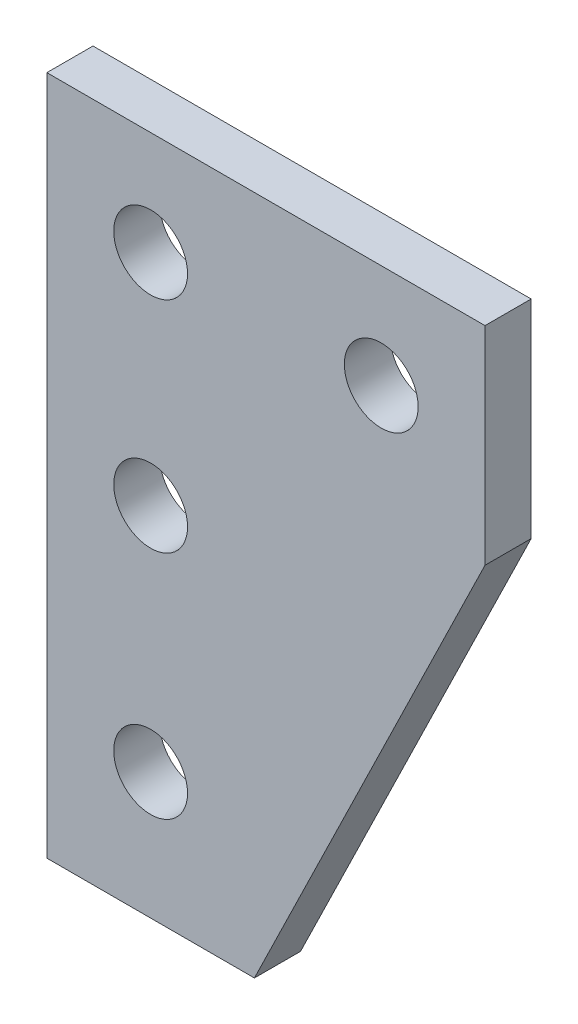
ISO-10303-21;
HEADER;
FILE_DESCRIPTION(('STEP AP214'),'2;1');
FILE_NAME('part.step','',(''),(''),'','','');
FILE_SCHEMA(('AUTOMOTIVE_DESIGN { 1 0 10303 214 1 1 1 1 }'));
ENDSEC;
DATA;
#1=APPLICATION_CONTEXT('core data for automotive mechanical design processes');
#2=APPLICATION_PROTOCOL_DEFINITION('international standard','automotive_design',2000,#1);
#3=PRODUCT_CONTEXT('',#1,'mechanical');
#4=PRODUCT('Part','Part','',(#3));
#5=PRODUCT_RELATED_PRODUCT_CATEGORY('part','',(#4));
#6=PRODUCT_DEFINITION_FORMATION('','',#4);
#7=PRODUCT_DEFINITION_CONTEXT('part definition',#1,'design');
#8=PRODUCT_DEFINITION('design','',#6,#7);
#9=PRODUCT_DEFINITION_SHAPE('','',#8);
#10=(LENGTH_UNIT() NAMED_UNIT(*) SI_UNIT(.MILLI.,.METRE.));
#11=(NAMED_UNIT(*) PLANE_ANGLE_UNIT() SI_UNIT($,.RADIAN.));
#12=(NAMED_UNIT(*) SI_UNIT($,.STERADIAN.) SOLID_ANGLE_UNIT());
#13=UNCERTAINTY_MEASURE_WITH_UNIT(LENGTH_MEASURE(1.E-05),#10,'distance_accuracy_value','');
#14=(GEOMETRIC_REPRESENTATION_CONTEXT(3) GLOBAL_UNCERTAINTY_ASSIGNED_CONTEXT((#13)) GLOBAL_UNIT_ASSIGNED_CONTEXT((#10,
#11,#12)) REPRESENTATION_CONTEXT('',''));
#15=CARTESIAN_POINT('',(0.,0.,0.));
#16=DIRECTION('',(0.,0.,1.));
#17=DIRECTION('',(1.,0.,0.));
#18=AXIS2_PLACEMENT_3D('',#15,#16,#17);
#19=CARTESIAN_POINT('',(-25.,-25.,2.));
#20=DIRECTION('',(0.,1.,0.));
#21=DIRECTION('',(0.,0.,1.));
#22=AXIS2_PLACEMENT_3D('',#19,#20,#21);
#23=PLANE('',#22);
#24=DIRECTION('',(0.,0.,1.));
#25=VECTOR('',#24,1.);
#26=CARTESIAN_POINT('',(4.5,-25.,-8.));
#27=LINE('',#26,#25);
#28=CARTESIAN_POINT('',(4.5,-25.,0.));
#29=VERTEX_POINT('',#28);
#30=CARTESIAN_POINT('',(4.5,-25.,2.));
#31=VERTEX_POINT('',#30);
#32=EDGE_CURVE('E95',#29,#31,#27,.T.);
#33=ORIENTED_EDGE('',*,*,#32,.T.);
#34=DIRECTION('',(1.,0.,0.));
#35=VECTOR('',#34,1.);
#36=CARTESIAN_POINT('',(-25.,-25.,2.));
#37=LINE('',#36,#35);
#38=CARTESIAN_POINT('',(-4.5,-25.,2.));
#39=VERTEX_POINT('',#38);
#40=EDGE_CURVE('E101',#39,#31,#37,.T.);
#41=ORIENTED_EDGE('',*,*,#40,.F.);
#42=DIRECTION('',(0.,0.,1.));
#43=VECTOR('',#42,1.);
#44=CARTESIAN_POINT('',(-4.5,-25.,-8.));
#45=LINE('',#44,#43);
#46=CARTESIAN_POINT('',(-4.5,-25.,0.));
#47=VERTEX_POINT('',#46);
#48=EDGE_CURVE('E83',#47,#39,#45,.T.);
#49=ORIENTED_EDGE('',*,*,#48,.F.);
#50=DIRECTION('',(1.,0.,0.));
#51=VECTOR('',#50,1.);
#52=CARTESIAN_POINT('',(-25.,-25.,0.));
#53=LINE('',#52,#51);
#54=EDGE_CURVE('E110',#47,#29,#53,.T.);
#55=ORIENTED_EDGE('',*,*,#54,.T.);
#56=EDGE_LOOP('',(#33,#41,#49,#55));
#57=FACE_BOUND('',#56,.T.);
#58=ADVANCED_FACE('F39',(#57),#23,.F.);
#59=CARTESIAN_POINT('',(0.,0.,2.));
#60=DIRECTION('',(0.,0.,1.));
#61=DIRECTION('',(1.,0.,0.));
#62=AXIS2_PLACEMENT_3D('',#59,#60,#61);
#63=PLANE('',#62);
#64=CARTESIAN_POINT('',(0.,-19.51,2.));
#65=DIRECTION('',(0.,0.,1.));
#66=DIRECTION('',(1.,0.,0.));
#67=AXIS2_PLACEMENT_3D('',#64,#65,#66);
#68=CIRCLE('',#67,1.6);
#69=CARTESIAN_POINT('',(1.6,-19.51,2.));
#70=VERTEX_POINT('',#69);
#71=EDGE_CURVE('E156',#70,#70,#68,.T.);
#72=ORIENTED_EDGE('',*,*,#71,.F.);
#73=EDGE_LOOP('',(#72));
#74=FACE_BOUND('',#73,.T.);
#75=CARTESIAN_POINT('',(0.,-9.51,2.));
#76=DIRECTION('',(0.,0.,1.));
#77=DIRECTION('',(1.,0.,0.));
#78=AXIS2_PLACEMENT_3D('',#75,#76,#77);
#79=CIRCLE('',#78,1.6);
#80=CARTESIAN_POINT('',(1.6,-9.51,2.));
#81=VERTEX_POINT('',#80);
#82=EDGE_CURVE('E167',#81,#81,#79,.T.);
#83=ORIENTED_EDGE('',*,*,#82,.F.);
#84=EDGE_LOOP('',(#83));
#85=FACE_BOUND('',#84,.T.);
#86=CARTESIAN_POINT('',(10.,0.,2.));
#87=DIRECTION('',(0.,0.,1.));
#88=DIRECTION('',(1.,0.,0.));
#89=AXIS2_PLACEMENT_3D('',#86,#87,#88);
#90=CIRCLE('',#89,1.6);
#91=CARTESIAN_POINT('',(11.6,0.,2.));
#92=VERTEX_POINT('',#91);
#93=EDGE_CURVE('E163',#92,#92,#90,.T.);
#94=ORIENTED_EDGE('',*,*,#93,.F.);
#95=EDGE_LOOP('',(#94));
#96=FACE_BOUND('',#95,.T.);
#97=CARTESIAN_POINT('',(0.,0.,2.));
#98=DIRECTION('',(0.,0.,1.));
#99=DIRECTION('',(1.,0.,0.));
#100=AXIS2_PLACEMENT_3D('',#97,#98,#99);
#101=CIRCLE('',#100,1.6);
#102=CARTESIAN_POINT('',(1.6,0.,2.));
#103=VERTEX_POINT('',#102);
#104=EDGE_CURVE('E119',#103,#103,#101,.T.);
#105=ORIENTED_EDGE('',*,*,#104,.F.);
#106=EDGE_LOOP('',(#105));
#107=FACE_BOUND('',#106,.T.);
#108=ORIENTED_EDGE('',*,*,#40,.T.);
#109=DIRECTION('',(0.438423632021414,0.8987684456439,0.));
#110=VECTOR('',#109,1.);
#111=CARTESIAN_POINT('',(14.5,-4.5,2.));
#112=LINE('',#111,#110);
#113=CARTESIAN_POINT('',(14.5,-4.5,2.));
#114=VERTEX_POINT('',#113);
#115=EDGE_CURVE('E106',#31,#114,#112,.T.);
#116=ORIENTED_EDGE('',*,*,#115,.T.);
#117=DIRECTION('',(0.,1.,0.));
#118=VECTOR('',#117,1.);
#119=CARTESIAN_POINT('',(14.5,4.5,2.));
#120=LINE('',#119,#118);
#121=CARTESIAN_POINT('',(14.5,4.5,2.));
#122=VERTEX_POINT('',#121);
#123=EDGE_CURVE('E151',#114,#122,#120,.T.);
#124=ORIENTED_EDGE('',*,*,#123,.T.);
#125=DIRECTION('',(-1.,0.,0.));
#126=VECTOR('',#125,1.);
#127=CARTESIAN_POINT('',(-4.5,4.5,2.));
#128=LINE('',#127,#126);
#129=CARTESIAN_POINT('',(-4.5,4.5,2.));
#130=VERTEX_POINT('',#129);
#131=EDGE_CURVE('E104',#122,#130,#128,.T.);
#132=ORIENTED_EDGE('',*,*,#131,.T.);
#133=DIRECTION('',(0.,-1.,0.));
#134=VECTOR('',#133,1.);
#135=CARTESIAN_POINT('',(-4.5,4.5,2.));
#136=LINE('',#135,#134);
#137=EDGE_CURVE('E86',#130,#39,#136,.T.);
#138=ORIENTED_EDGE('',*,*,#137,.T.);
#139=EDGE_LOOP('',(#108,#116,#124,#132,#138));
#140=FACE_BOUND('',#139,.T.);
#141=ADVANCED_FACE('F99',(#74,#85,#96,#107,#140),#63,.T.);
#142=CARTESIAN_POINT('',(0.,0.,0.));
#143=DIRECTION('',(0.,0.,1.));
#144=DIRECTION('',(1.,0.,0.));
#145=AXIS2_PLACEMENT_3D('',#142,#143,#144);
#146=PLANE('',#145);
#147=CARTESIAN_POINT('',(0.,0.,0.));
#148=DIRECTION('',(0.,0.,1.));
#149=DIRECTION('',(1.,0.,0.));
#150=AXIS2_PLACEMENT_3D('',#147,#148,#149);
#151=CIRCLE('',#150,1.6);
#152=CARTESIAN_POINT('',(1.6,0.,0.));
#153=VERTEX_POINT('',#152);
#154=EDGE_CURVE('E122',#153,#153,#151,.T.);
#155=ORIENTED_EDGE('',*,*,#154,.T.);
#156=EDGE_LOOP('',(#155));
#157=FACE_BOUND('',#156,.T.);
#158=CARTESIAN_POINT('',(10.,0.,0.));
#159=DIRECTION('',(0.,0.,1.));
#160=DIRECTION('',(1.,0.,0.));
#161=AXIS2_PLACEMENT_3D('',#158,#159,#160);
#162=CIRCLE('',#161,1.6);
#163=CARTESIAN_POINT('',(11.6,0.,0.));
#164=VERTEX_POINT('',#163);
#165=EDGE_CURVE('E126',#164,#164,#162,.T.);
#166=ORIENTED_EDGE('',*,*,#165,.T.);
#167=EDGE_LOOP('',(#166));
#168=FACE_BOUND('',#167,.T.);
#169=CARTESIAN_POINT('',(0.,-9.51,0.));
#170=DIRECTION('',(0.,0.,1.));
#171=DIRECTION('',(1.,0.,0.));
#172=AXIS2_PLACEMENT_3D('',#169,#170,#171);
#173=CIRCLE('',#172,1.6);
#174=CARTESIAN_POINT('',(1.6,-9.51,0.));
#175=VERTEX_POINT('',#174);
#176=EDGE_CURVE('E130',#175,#175,#173,.T.);
#177=ORIENTED_EDGE('',*,*,#176,.T.);
#178=EDGE_LOOP('',(#177));
#179=FACE_BOUND('',#178,.T.);
#180=CARTESIAN_POINT('',(0.,-19.51,0.));
#181=DIRECTION('',(0.,0.,1.));
#182=DIRECTION('',(1.,0.,0.));
#183=AXIS2_PLACEMENT_3D('',#180,#181,#182);
#184=CIRCLE('',#183,1.6);
#185=CARTESIAN_POINT('',(1.6,-19.51,0.));
#186=VERTEX_POINT('',#185);
#187=EDGE_CURVE('E116',#186,#186,#184,.T.);
#188=ORIENTED_EDGE('',*,*,#187,.T.);
#189=EDGE_LOOP('',(#188));
#190=FACE_BOUND('',#189,.T.);
#191=DIRECTION('',(0.438423632021414,0.8987684456439,0.));
#192=VECTOR('',#191,1.);
#193=CARTESIAN_POINT('',(13.4860643921192,-6.57856799615569,0.));
#194=LINE('',#193,#192);
#195=CARTESIAN_POINT('',(14.5,-4.5,0.));
#196=VERTEX_POINT('',#195);
#197=EDGE_CURVE('E11',#29,#196,#194,.T.);
#198=ORIENTED_EDGE('',*,*,#197,.F.);
#199=ORIENTED_EDGE('',*,*,#54,.F.);
#200=DIRECTION('',(0.,-1.,0.));
#201=VECTOR('',#200,1.);
#202=CARTESIAN_POINT('',(-4.5,0.,0.));
#203=LINE('',#202,#201);
#204=CARTESIAN_POINT('',(-4.5,4.5,0.));
#205=VERTEX_POINT('',#204);
#206=EDGE_CURVE('E89',#205,#47,#203,.T.);
#207=ORIENTED_EDGE('',*,*,#206,.F.);
#208=DIRECTION('',(-1.,0.,0.));
#209=VECTOR('',#208,1.);
#210=CARTESIAN_POINT('',(0.,4.5,0.));
#211=LINE('',#210,#209);
#212=CARTESIAN_POINT('',(14.5,4.5,0.));
#213=VERTEX_POINT('',#212);
#214=EDGE_CURVE('E114',#213,#205,#211,.T.);
#215=ORIENTED_EDGE('',*,*,#214,.F.);
#216=DIRECTION('',(0.,1.,0.));
#217=VECTOR('',#216,1.);
#218=CARTESIAN_POINT('',(14.5,0.,0.));
#219=LINE('',#218,#217);
#220=EDGE_CURVE('E47',#196,#213,#219,.T.);
#221=ORIENTED_EDGE('',*,*,#220,.F.);
#222=EDGE_LOOP('',(#198,#199,#207,#215,#221));
#223=FACE_BOUND('',#222,.T.);
#224=ADVANCED_FACE('F145',(#157,#168,#179,#190,#223),#146,.F.);
#225=CARTESIAN_POINT('',(0.,0.,-8.));
#226=DIRECTION('',(0.,0.,1.));
#227=DIRECTION('',(1.,0.,0.));
#228=AXIS2_PLACEMENT_3D('',#225,#226,#227);
#229=CYLINDRICAL_SURFACE('',#228,1.6);
#230=ORIENTED_EDGE('',*,*,#104,.T.);
#231=EDGE_LOOP('',(#230));
#232=FACE_BOUND('',#231,.T.);
#233=ORIENTED_EDGE('',*,*,#154,.F.);
#234=EDGE_LOOP('',(#233));
#235=FACE_BOUND('',#234,.T.);
#236=ADVANCED_FACE('F188',(#232,#235),#229,.F.);
#237=CARTESIAN_POINT('',(10.,0.,-8.));
#238=DIRECTION('',(0.,0.,1.));
#239=DIRECTION('',(1.,0.,0.));
#240=AXIS2_PLACEMENT_3D('',#237,#238,#239);
#241=CYLINDRICAL_SURFACE('',#240,1.6);
#242=ORIENTED_EDGE('',*,*,#93,.T.);
#243=EDGE_LOOP('',(#242));
#244=FACE_BOUND('',#243,.T.);
#245=ORIENTED_EDGE('',*,*,#165,.F.);
#246=EDGE_LOOP('',(#245));
#247=FACE_BOUND('',#246,.T.);
#248=ADVANCED_FACE('F191',(#244,#247),#241,.F.);
#249=CARTESIAN_POINT('',(0.,-9.51,-8.));
#250=DIRECTION('',(0.,0.,1.));
#251=DIRECTION('',(1.,0.,0.));
#252=AXIS2_PLACEMENT_3D('',#249,#250,#251);
#253=CYLINDRICAL_SURFACE('',#252,1.6);
#254=ORIENTED_EDGE('',*,*,#82,.T.);
#255=EDGE_LOOP('',(#254));
#256=FACE_BOUND('',#255,.T.);
#257=ORIENTED_EDGE('',*,*,#176,.F.);
#258=EDGE_LOOP('',(#257));
#259=FACE_BOUND('',#258,.T.);
#260=ADVANCED_FACE('F203',(#256,#259),#253,.F.);
#261=CARTESIAN_POINT('',(0.,-19.51,-8.));
#262=DIRECTION('',(0.,0.,1.));
#263=DIRECTION('',(1.,0.,0.));
#264=AXIS2_PLACEMENT_3D('',#261,#262,#263);
#265=CYLINDRICAL_SURFACE('',#264,1.6);
#266=ORIENTED_EDGE('',*,*,#71,.T.);
#267=EDGE_LOOP('',(#266));
#268=FACE_BOUND('',#267,.T.);
#269=ORIENTED_EDGE('',*,*,#187,.F.);
#270=EDGE_LOOP('',(#269));
#271=FACE_BOUND('',#270,.T.);
#272=ADVANCED_FACE('F174',(#268,#271),#265,.F.);
#273=CARTESIAN_POINT('',(-4.5,4.5,-8.));
#274=DIRECTION('',(0.,1.,0.));
#275=DIRECTION('',(0.,0.,1.));
#276=AXIS2_PLACEMENT_3D('',#273,#274,#275);
#277=PLANE('',#276);
#278=ORIENTED_EDGE('',*,*,#214,.T.);
#279=DIRECTION('',(0.,0.,1.));
#280=VECTOR('',#279,1.);
#281=CARTESIAN_POINT('',(-4.5,4.5,-8.));
#282=LINE('',#281,#280);
#283=EDGE_CURVE('E54',#205,#130,#282,.T.);
#284=ORIENTED_EDGE('',*,*,#283,.T.);
#285=ORIENTED_EDGE('',*,*,#131,.F.);
#286=DIRECTION('',(0.,0.,1.));
#287=VECTOR('',#286,1.);
#288=CARTESIAN_POINT('',(14.5,4.5,-8.));
#289=LINE('',#288,#287);
#290=EDGE_CURVE('E142',#213,#122,#289,.T.);
#291=ORIENTED_EDGE('',*,*,#290,.F.);
#292=EDGE_LOOP('',(#278,#284,#285,#291));
#293=FACE_BOUND('',#292,.T.);
#294=ADVANCED_FACE('F141',(#293),#277,.T.);
#295=CARTESIAN_POINT('',(14.5,4.5,-8.));
#296=DIRECTION('',(1.,0.,0.));
#297=DIRECTION('',(0.,0.,-1.));
#298=AXIS2_PLACEMENT_3D('',#295,#296,#297);
#299=PLANE('',#298);
#300=ORIENTED_EDGE('',*,*,#220,.T.);
#301=ORIENTED_EDGE('',*,*,#290,.T.);
#302=ORIENTED_EDGE('',*,*,#123,.F.);
#303=DIRECTION('',(0.,0.,1.));
#304=VECTOR('',#303,1.);
#305=CARTESIAN_POINT('',(14.5,-4.5,-8.));
#306=LINE('',#305,#304);
#307=EDGE_CURVE('E148',#196,#114,#306,.T.);
#308=ORIENTED_EDGE('',*,*,#307,.F.);
#309=EDGE_LOOP('',(#300,#301,#302,#308));
#310=FACE_BOUND('',#309,.T.);
#311=ADVANCED_FACE('F150',(#310),#299,.T.);
#312=CARTESIAN_POINT('',(14.5,-4.5,-8.));
#313=DIRECTION('',(0.8987684456439,-0.438423632021414,0.));
#314=DIRECTION('',(0.438423632021414,0.8987684456439,0.));
#315=AXIS2_PLACEMENT_3D('',#312,#313,#314);
#316=PLANE('',#315);
#317=ORIENTED_EDGE('',*,*,#197,.T.);
#318=ORIENTED_EDGE('',*,*,#307,.T.);
#319=ORIENTED_EDGE('',*,*,#115,.F.);
#320=ORIENTED_EDGE('',*,*,#32,.F.);
#321=EDGE_LOOP('',(#317,#318,#319,#320));
#322=FACE_BOUND('',#321,.T.);
#323=ADVANCED_FACE('F147',(#322),#316,.T.);
#324=CARTESIAN_POINT('',(-4.5,4.5,-8.));
#325=DIRECTION('',(-1.,0.,0.));
#326=DIRECTION('',(0.,-1.,0.));
#327=AXIS2_PLACEMENT_3D('',#324,#325,#326);
#328=PLANE('',#327);
#329=ORIENTED_EDGE('',*,*,#206,.T.);
#330=ORIENTED_EDGE('',*,*,#48,.T.);
#331=ORIENTED_EDGE('',*,*,#137,.F.);
#332=ORIENTED_EDGE('',*,*,#283,.F.);
#333=EDGE_LOOP('',(#329,#330,#331,#332));
#334=FACE_BOUND('',#333,.T.);
#335=ADVANCED_FACE('F85',(#334),#328,.T.);
#336=CLOSED_SHELL('',(#58,#141,#224,#236,#248,#260,#272,#294,#311,#323,#335));
#337=MANIFOLD_SOLID_BREP('B2',#336);
#338=ADVANCED_BREP_SHAPE_REPRESENTATION('',(#18,#337),#14);
#339=SHAPE_DEFINITION_REPRESENTATION(#9,#338);
ENDSEC;
END-ISO-10303-21;
